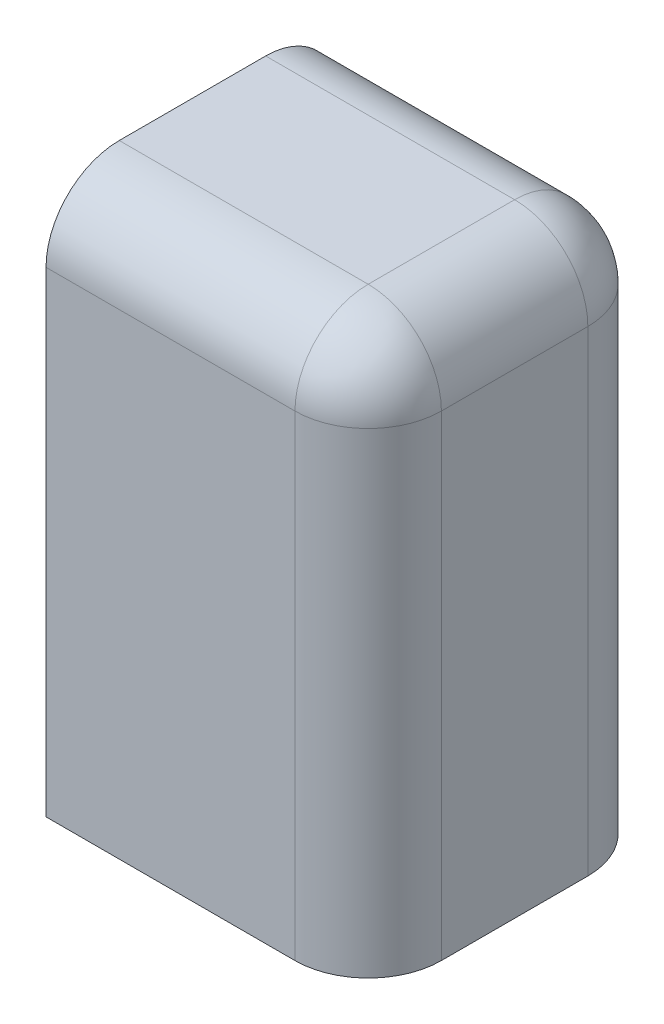
ISO-10303-21;
HEADER;
FILE_DESCRIPTION(('STEP AP214'),'2;1');
FILE_NAME('part.step','',(''),(''),'','','');
FILE_SCHEMA(('AUTOMOTIVE_DESIGN { 1 0 10303 214 1 1 1 1 }'));
ENDSEC;
DATA;
#1=APPLICATION_CONTEXT('core data for automotive mechanical design processes');
#2=APPLICATION_PROTOCOL_DEFINITION('international standard','automotive_design',2000,#1);
#3=PRODUCT_CONTEXT('',#1,'mechanical');
#4=PRODUCT('Part','Part','',(#3));
#5=PRODUCT_RELATED_PRODUCT_CATEGORY('part','',(#4));
#6=PRODUCT_DEFINITION_FORMATION('','',#4);
#7=PRODUCT_DEFINITION_CONTEXT('part definition',#1,'design');
#8=PRODUCT_DEFINITION('design','',#6,#7);
#9=PRODUCT_DEFINITION_SHAPE('','',#8);
#10=(LENGTH_UNIT() NAMED_UNIT(*) SI_UNIT(.MILLI.,.METRE.));
#11=(NAMED_UNIT(*) PLANE_ANGLE_UNIT() SI_UNIT($,.RADIAN.));
#12=(NAMED_UNIT(*) SI_UNIT($,.STERADIAN.) SOLID_ANGLE_UNIT());
#13=UNCERTAINTY_MEASURE_WITH_UNIT(LENGTH_MEASURE(1.E-05),#10,'distance_accuracy_value','');
#14=(GEOMETRIC_REPRESENTATION_CONTEXT(3) GLOBAL_UNCERTAINTY_ASSIGNED_CONTEXT((#13)) GLOBAL_UNIT_ASSIGNED_CONTEXT((#10,
#11,#12)) REPRESENTATION_CONTEXT('',''));
#15=CARTESIAN_POINT('',(0.,0.,0.));
#16=DIRECTION('',(0.,0.,1.));
#17=DIRECTION('',(1.,0.,0.));
#18=AXIS2_PLACEMENT_3D('',#15,#16,#17);
#19=CARTESIAN_POINT('',(0.,7.5,0.));
#20=DIRECTION('',(1.,0.,0.));
#21=DIRECTION('',(0.,0.,-1.));
#22=AXIS2_PLACEMENT_3D('',#19,#20,#21);
#23=PLANE('',#22);
#24=DIRECTION('',(0.,-1.,0.));
#25=VECTOR('',#24,1.);
#26=CARTESIAN_POINT('',(0.,7.5,0.));
#27=LINE('',#26,#25);
#28=CARTESIAN_POINT('',(0.,6.5,0.));
#29=VERTEX_POINT('',#28);
#30=CARTESIAN_POINT('',(0.,0.,0.));
#31=VERTEX_POINT('',#30);
#32=EDGE_CURVE('E112',#29,#31,#27,.T.);
#33=ORIENTED_EDGE('',*,*,#32,.F.);
#34=CARTESIAN_POINT('',(0.,6.5,-1.));
#35=DIRECTION('',(1.,0.,0.));
#36=DIRECTION('',(0.,0.,-1.));
#37=AXIS2_PLACEMENT_3D('',#34,#35,#36);
#38=CIRCLE('',#37,1.);
#39=CARTESIAN_POINT('',(0.,7.5,-1.));
#40=VERTEX_POINT('',#39);
#41=EDGE_CURVE('E173',#29,#40,#38,.F.);
#42=ORIENTED_EDGE('',*,*,#41,.T.);
#43=DIRECTION('',(0.,0.,1.));
#44=VECTOR('',#43,1.);
#45=CARTESIAN_POINT('',(0.,7.5,0.));
#46=LINE('',#45,#44);
#47=CARTESIAN_POINT('',(0.,7.5,-3.));
#48=VERTEX_POINT('',#47);
#49=EDGE_CURVE('E146',#48,#40,#46,.T.);
#50=ORIENTED_EDGE('',*,*,#49,.F.);
#51=CARTESIAN_POINT('',(0.,6.5,-3.));
#52=DIRECTION('',(1.,0.,0.));
#53=DIRECTION('',(0.,0.,-1.));
#54=AXIS2_PLACEMENT_3D('',#51,#52,#53);
#55=CIRCLE('',#54,1.);
#56=CARTESIAN_POINT('',(0.,6.5,-4.));
#57=VERTEX_POINT('',#56);
#58=EDGE_CURVE('E170',#48,#57,#55,.F.);
#59=ORIENTED_EDGE('',*,*,#58,.T.);
#60=DIRECTION('',(0.,-1.,0.));
#61=VECTOR('',#60,1.);
#62=CARTESIAN_POINT('',(0.,7.5,-4.));
#63=LINE('',#62,#61);
#64=CARTESIAN_POINT('',(0.,0.,-4.));
#65=VERTEX_POINT('',#64);
#66=EDGE_CURVE('E124',#57,#65,#63,.T.);
#67=ORIENTED_EDGE('',*,*,#66,.T.);
#68=DIRECTION('',(0.,0.,1.));
#69=VECTOR('',#68,1.);
#70=CARTESIAN_POINT('',(0.,0.,0.));
#71=LINE('',#70,#69);
#72=EDGE_CURVE('E130',#65,#31,#71,.T.);
#73=ORIENTED_EDGE('',*,*,#72,.T.);
#74=EDGE_LOOP('',(#33,#42,#50,#59,#67,#73));
#75=FACE_BOUND('',#74,.T.);
#76=ADVANCED_FACE('F45',(#75),#23,.F.);
#77=CARTESIAN_POINT('',(0.,7.5,0.));
#78=DIRECTION('',(0.,0.,-1.));
#79=DIRECTION('',(-1.,0.,0.));
#80=AXIS2_PLACEMENT_3D('',#77,#78,#79);
#81=PLANE('',#80);
#82=DIRECTION('',(0.,-1.,0.));
#83=VECTOR('',#82,1.);
#84=CARTESIAN_POINT('',(3.4,7.5,0.));
#85=LINE('',#84,#83);
#86=CARTESIAN_POINT('',(3.4,0.,0.));
#87=VERTEX_POINT('',#86);
#88=CARTESIAN_POINT('',(3.4,6.5,0.));
#89=VERTEX_POINT('',#88);
#90=EDGE_CURVE('E165',#87,#89,#85,.F.);
#91=ORIENTED_EDGE('',*,*,#90,.T.);
#92=DIRECTION('',(1.,0.,0.));
#93=VECTOR('',#92,1.);
#94=CARTESIAN_POINT('',(0.,6.5,0.));
#95=LINE('',#94,#93);
#96=EDGE_CURVE('E118',#89,#29,#95,.F.);
#97=ORIENTED_EDGE('',*,*,#96,.T.);
#98=ORIENTED_EDGE('',*,*,#32,.T.);
#99=DIRECTION('',(1.,0.,0.));
#100=VECTOR('',#99,1.);
#101=CARTESIAN_POINT('',(0.,0.,0.));
#102=LINE('',#101,#100);
#103=EDGE_CURVE('E115',#31,#87,#102,.T.);
#104=ORIENTED_EDGE('',*,*,#103,.T.);
#105=EDGE_LOOP('',(#91,#97,#98,#104));
#106=FACE_BOUND('',#105,.T.);
#107=ADVANCED_FACE('F114',(#106),#81,.F.);
#108=CARTESIAN_POINT('',(4.4,7.5,0.));
#109=DIRECTION('',(-1.,0.,0.));
#110=DIRECTION('',(0.,0.,1.));
#111=AXIS2_PLACEMENT_3D('',#108,#109,#110);
#112=PLANE('',#111);
#113=DIRECTION('',(0.,0.,-1.));
#114=VECTOR('',#113,1.);
#115=CARTESIAN_POINT('',(4.4,0.,0.));
#116=LINE('',#115,#114);
#117=CARTESIAN_POINT('',(4.4,0.,-1.));
#118=VERTEX_POINT('',#117);
#119=CARTESIAN_POINT('',(4.4,0.,-3.));
#120=VERTEX_POINT('',#119);
#121=EDGE_CURVE('E134',#118,#120,#116,.T.);
#122=ORIENTED_EDGE('',*,*,#121,.T.);
#123=DIRECTION('',(0.,-1.,0.));
#124=VECTOR('',#123,1.);
#125=CARTESIAN_POINT('',(4.4,7.5,-3.));
#126=LINE('',#125,#124);
#127=CARTESIAN_POINT('',(4.4,6.5,-3.));
#128=VERTEX_POINT('',#127);
#129=EDGE_CURVE('E63',#120,#128,#126,.F.);
#130=ORIENTED_EDGE('',*,*,#129,.T.);
#131=DIRECTION('',(0.,0.,-1.));
#132=VECTOR('',#131,1.);
#133=CARTESIAN_POINT('',(4.4,6.5,0.));
#134=LINE('',#133,#132);
#135=CARTESIAN_POINT('',(4.4,6.5,-1.));
#136=VERTEX_POINT('',#135);
#137=EDGE_CURVE('E68',#128,#136,#134,.F.);
#138=ORIENTED_EDGE('',*,*,#137,.T.);
#139=DIRECTION('',(0.,-1.,0.));
#140=VECTOR('',#139,1.);
#141=CARTESIAN_POINT('',(4.4,7.5,-1.));
#142=LINE('',#141,#140);
#143=EDGE_CURVE('E182',#136,#118,#142,.T.);
#144=ORIENTED_EDGE('',*,*,#143,.T.);
#145=EDGE_LOOP('',(#122,#130,#138,#144));
#146=FACE_BOUND('',#145,.T.);
#147=ADVANCED_FACE('F240',(#146),#112,.F.);
#148=CARTESIAN_POINT('',(0.,7.5,-4.));
#149=DIRECTION('',(0.,0.,1.));
#150=DIRECTION('',(1.,0.,0.));
#151=AXIS2_PLACEMENT_3D('',#148,#149,#150);
#152=PLANE('',#151);
#153=ORIENTED_EDGE('',*,*,#66,.F.);
#154=DIRECTION('',(-1.,0.,0.));
#155=VECTOR('',#154,1.);
#156=CARTESIAN_POINT('',(0.,6.5,-4.));
#157=LINE('',#156,#155);
#158=CARTESIAN_POINT('',(3.4,6.5,-4.));
#159=VERTEX_POINT('',#158);
#160=EDGE_CURVE('E179',#57,#159,#157,.F.);
#161=ORIENTED_EDGE('',*,*,#160,.T.);
#162=DIRECTION('',(0.,-1.,0.));
#163=VECTOR('',#162,1.);
#164=CARTESIAN_POINT('',(3.4,7.5,-4.));
#165=LINE('',#164,#163);
#166=CARTESIAN_POINT('',(3.4,0.,-4.));
#167=VERTEX_POINT('',#166);
#168=EDGE_CURVE('E176',#159,#167,#165,.T.);
#169=ORIENTED_EDGE('',*,*,#168,.T.);
#170=DIRECTION('',(-1.,0.,0.));
#171=VECTOR('',#170,1.);
#172=CARTESIAN_POINT('',(0.,0.,-4.));
#173=LINE('',#172,#171);
#174=EDGE_CURVE('E151',#167,#65,#173,.T.);
#175=ORIENTED_EDGE('',*,*,#174,.T.);
#176=EDGE_LOOP('',(#153,#161,#169,#175));
#177=FACE_BOUND('',#176,.T.);
#178=ADVANCED_FACE('F230',(#177),#152,.F.);
#179=CARTESIAN_POINT('',(0.,7.5,0.));
#180=DIRECTION('',(0.,-1.,0.));
#181=DIRECTION('',(0.,0.,-1.));
#182=AXIS2_PLACEMENT_3D('',#179,#180,#181);
#183=PLANE('',#182);
#184=ORIENTED_EDGE('',*,*,#49,.T.);
#185=DIRECTION('',(1.,0.,0.));
#186=VECTOR('',#185,1.);
#187=CARTESIAN_POINT('',(0.,7.5,-1.));
#188=LINE('',#187,#186);
#189=CARTESIAN_POINT('',(3.4,7.5,-1.));
#190=VERTEX_POINT('',#189);
#191=EDGE_CURVE('E161',#40,#190,#188,.T.);
#192=ORIENTED_EDGE('',*,*,#191,.T.);
#193=DIRECTION('',(0.,0.,-1.));
#194=VECTOR('',#193,1.);
#195=CARTESIAN_POINT('',(3.4,7.5,0.));
#196=LINE('',#195,#194);
#197=CARTESIAN_POINT('',(3.4,7.5,-3.));
#198=VERTEX_POINT('',#197);
#199=EDGE_CURVE('E123',#190,#198,#196,.T.);
#200=ORIENTED_EDGE('',*,*,#199,.T.);
#201=DIRECTION('',(-1.,0.,0.));
#202=VECTOR('',#201,1.);
#203=CARTESIAN_POINT('',(0.,7.5,-3.));
#204=LINE('',#203,#202);
#205=EDGE_CURVE('E158',#198,#48,#204,.T.);
#206=ORIENTED_EDGE('',*,*,#205,.T.);
#207=EDGE_LOOP('',(#184,#192,#200,#206));
#208=FACE_BOUND('',#207,.T.);
#209=ADVANCED_FACE('F220',(#208),#183,.F.);
#210=CARTESIAN_POINT('',(0.,0.,0.));
#211=DIRECTION('',(0.,-1.,0.));
#212=DIRECTION('',(0.,0.,-1.));
#213=AXIS2_PLACEMENT_3D('',#210,#211,#212);
#214=PLANE('',#213);
#215=CARTESIAN_POINT('',(2.4,0.,-2.));
#216=DIRECTION('',(0.,-1.,0.));
#217=DIRECTION('',(0.,0.,-1.));
#218=AXIS2_PLACEMENT_3D('',#215,#216,#217);
#219=CIRCLE('',#218,0.925);
#220=CARTESIAN_POINT('',(2.4,0.,-2.925));
#221=VERTEX_POINT('',#220);
#222=EDGE_CURVE('E143',#221,#221,#219,.T.);
#223=ORIENTED_EDGE('',*,*,#222,.F.);
#224=EDGE_LOOP('',(#223));
#225=FACE_BOUND('',#224,.T.);
#226=ORIENTED_EDGE('',*,*,#174,.F.);
#227=CARTESIAN_POINT('',(3.4,0.,-3.));
#228=DIRECTION('',(0.,-1.,0.));
#229=DIRECTION('',(0.,0.,-1.));
#230=AXIS2_PLACEMENT_3D('',#227,#228,#229);
#231=CIRCLE('',#230,1.);
#232=EDGE_CURVE('E11',#167,#120,#231,.T.);
#233=ORIENTED_EDGE('',*,*,#232,.T.);
#234=ORIENTED_EDGE('',*,*,#121,.F.);
#235=CARTESIAN_POINT('',(3.4,0.,-1.));
#236=DIRECTION('',(0.,-1.,0.));
#237=DIRECTION('',(0.,0.,-1.));
#238=AXIS2_PLACEMENT_3D('',#235,#236,#237);
#239=CIRCLE('',#238,1.);
#240=EDGE_CURVE('E55',#118,#87,#239,.T.);
#241=ORIENTED_EDGE('',*,*,#240,.T.);
#242=ORIENTED_EDGE('',*,*,#103,.F.);
#243=ORIENTED_EDGE('',*,*,#72,.F.);
#244=EDGE_LOOP('',(#226,#233,#234,#241,#242,#243));
#245=FACE_BOUND('',#244,.T.);
#246=ADVANCED_FACE('F129',(#225,#245),#214,.T.);
#247=CARTESIAN_POINT('',(2.4,5.5,-2.));
#248=DIRECTION('',(0.,-1.,0.));
#249=DIRECTION('',(0.,0.,-1.));
#250=AXIS2_PLACEMENT_3D('',#247,#248,#249);
#251=CYLINDRICAL_SURFACE('',#250,0.925);
#252=CARTESIAN_POINT('',(2.4,5.5,-2.));
#253=DIRECTION('',(0.,-1.,0.));
#254=DIRECTION('',(0.,0.,-1.));
#255=AXIS2_PLACEMENT_3D('',#252,#253,#254);
#256=CIRCLE('',#255,0.925);
#257=CARTESIAN_POINT('',(2.4,5.5,-2.925));
#258=VERTEX_POINT('',#257);
#259=EDGE_CURVE('E139',#258,#258,#256,.T.);
#260=ORIENTED_EDGE('',*,*,#259,.F.);
#261=EDGE_LOOP('',(#260));
#262=FACE_BOUND('',#261,.T.);
#263=ORIENTED_EDGE('',*,*,#222,.T.);
#264=EDGE_LOOP('',(#263));
#265=FACE_BOUND('',#264,.T.);
#266=ADVANCED_FACE('F217',(#262,#265),#251,.F.);
#267=CARTESIAN_POINT('',(2.4,5.5,-2.));
#268=DIRECTION('',(0.,-1.,0.));
#269=DIRECTION('',(0.,0.,-1.));
#270=AXIS2_PLACEMENT_3D('',#267,#268,#269);
#271=PLANE('',#270);
#272=ORIENTED_EDGE('',*,*,#259,.T.);
#273=EDGE_LOOP('',(#272));
#274=FACE_BOUND('',#273,.T.);
#275=ADVANCED_FACE('F227',(#274),#271,.T.);
#276=CARTESIAN_POINT('',(0.,6.5,-3.));
#277=DIRECTION('',(-1.,0.,0.));
#278=DIRECTION('',(0.,0.,1.));
#279=AXIS2_PLACEMENT_3D('',#276,#277,#278);
#280=CYLINDRICAL_SURFACE('',#279,1.);
#281=ORIENTED_EDGE('',*,*,#58,.F.);
#282=ORIENTED_EDGE('',*,*,#205,.F.);
#283=CARTESIAN_POINT('',(3.4,6.5,-3.));
#284=DIRECTION('',(1.,0.,0.));
#285=DIRECTION('',(0.,0.,-1.));
#286=AXIS2_PLACEMENT_3D('',#283,#284,#285);
#287=CIRCLE('',#286,1.);
#288=EDGE_CURVE('E49',#159,#198,#287,.T.);
#289=ORIENTED_EDGE('',*,*,#288,.F.);
#290=ORIENTED_EDGE('',*,*,#160,.F.);
#291=EDGE_LOOP('',(#281,#282,#289,#290));
#292=FACE_BOUND('',#291,.T.);
#293=ADVANCED_FACE('F47',(#292),#280,.T.);
#294=CARTESIAN_POINT('',(3.4,7.5,-3.));
#295=DIRECTION('',(0.,-1.,0.));
#296=DIRECTION('',(0.,0.,-1.));
#297=AXIS2_PLACEMENT_3D('',#294,#295,#296);
#298=CYLINDRICAL_SURFACE('',#297,1.);
#299=ORIENTED_EDGE('',*,*,#232,.F.);
#300=ORIENTED_EDGE('',*,*,#168,.F.);
#301=CARTESIAN_POINT('',(3.4,6.5,-3.));
#302=DIRECTION('',(0.,1.,0.));
#303=DIRECTION('',(0.,0.,1.));
#304=AXIS2_PLACEMENT_3D('',#301,#302,#303);
#305=CIRCLE('',#304,1.);
#306=EDGE_CURVE('E205',#128,#159,#305,.T.);
#307=ORIENTED_EDGE('',*,*,#306,.F.);
#308=ORIENTED_EDGE('',*,*,#129,.F.);
#309=EDGE_LOOP('',(#299,#300,#307,#308));
#310=FACE_BOUND('',#309,.T.);
#311=ADVANCED_FACE('F262',(#310),#298,.T.);
#312=CARTESIAN_POINT('',(3.4,6.5,-3.));
#313=DIRECTION('',(0.,0.,-1.));
#314=DIRECTION('',(-1.,0.,0.));
#315=AXIS2_PLACEMENT_3D('',#312,#313,#314);
#316=SPHERICAL_SURFACE('',#315,1.);
#317=ORIENTED_EDGE('',*,*,#306,.T.);
#318=ORIENTED_EDGE('',*,*,#288,.T.);
#319=CARTESIAN_POINT('',(3.4,6.5,-3.));
#320=DIRECTION('',(0.,0.,-1.));
#321=DIRECTION('',(-1.,0.,0.));
#322=AXIS2_PLACEMENT_3D('',#319,#320,#321);
#323=CIRCLE('',#322,1.);
#324=EDGE_CURVE('E202',#128,#198,#323,.F.);
#325=ORIENTED_EDGE('',*,*,#324,.F.);
#326=EDGE_LOOP('',(#317,#318,#325));
#327=FACE_BOUND('',#326,.T.);
#328=ADVANCED_FACE('F259',(#327),#316,.T.);
#329=CARTESIAN_POINT('',(3.4,6.5,0.));
#330=DIRECTION('',(0.,0.,-1.));
#331=DIRECTION('',(-1.,0.,0.));
#332=AXIS2_PLACEMENT_3D('',#329,#330,#331);
#333=CYLINDRICAL_SURFACE('',#332,1.);
#334=ORIENTED_EDGE('',*,*,#324,.T.);
#335=ORIENTED_EDGE('',*,*,#199,.F.);
#336=CARTESIAN_POINT('',(3.4,6.5,-1.));
#337=DIRECTION('',(0.,0.,1.));
#338=DIRECTION('',(1.,0.,0.));
#339=AXIS2_PLACEMENT_3D('',#336,#337,#338);
#340=CIRCLE('',#339,1.);
#341=EDGE_CURVE('E198',#136,#190,#340,.T.);
#342=ORIENTED_EDGE('',*,*,#341,.F.);
#343=ORIENTED_EDGE('',*,*,#137,.F.);
#344=EDGE_LOOP('',(#334,#335,#342,#343));
#345=FACE_BOUND('',#344,.T.);
#346=ADVANCED_FACE('F255',(#345),#333,.T.);
#347=CARTESIAN_POINT('',(3.4,7.5,-1.));
#348=DIRECTION('',(0.,-1.,0.));
#349=DIRECTION('',(0.,0.,-1.));
#350=AXIS2_PLACEMENT_3D('',#347,#348,#349);
#351=CYLINDRICAL_SURFACE('',#350,1.);
#352=ORIENTED_EDGE('',*,*,#240,.F.);
#353=ORIENTED_EDGE('',*,*,#143,.F.);
#354=CARTESIAN_POINT('',(3.4,6.5,-1.));
#355=DIRECTION('',(0.,1.,0.));
#356=DIRECTION('',(0.,0.,1.));
#357=AXIS2_PLACEMENT_3D('',#354,#355,#356);
#358=CIRCLE('',#357,1.);
#359=EDGE_CURVE('E194',#89,#136,#358,.T.);
#360=ORIENTED_EDGE('',*,*,#359,.F.);
#361=ORIENTED_EDGE('',*,*,#90,.F.);
#362=EDGE_LOOP('',(#352,#353,#360,#361));
#363=FACE_BOUND('',#362,.T.);
#364=ADVANCED_FACE('F251',(#363),#351,.T.);
#365=CARTESIAN_POINT('',(3.4,6.5,-1.));
#366=DIRECTION('',(1.,0.,0.));
#367=DIRECTION('',(0.,0.,-1.));
#368=AXIS2_PLACEMENT_3D('',#365,#366,#367);
#369=SPHERICAL_SURFACE('',#368,1.);
#370=ORIENTED_EDGE('',*,*,#359,.T.);
#371=ORIENTED_EDGE('',*,*,#341,.T.);
#372=CARTESIAN_POINT('',(3.4,6.5,-1.));
#373=DIRECTION('',(1.,0.,0.));
#374=DIRECTION('',(0.,0.,-1.));
#375=AXIS2_PLACEMENT_3D('',#372,#373,#374);
#376=CIRCLE('',#375,1.);
#377=EDGE_CURVE('E191',#89,#190,#376,.F.);
#378=ORIENTED_EDGE('',*,*,#377,.F.);
#379=EDGE_LOOP('',(#370,#371,#378));
#380=FACE_BOUND('',#379,.T.);
#381=ADVANCED_FACE('F247',(#380),#369,.T.);
#382=CARTESIAN_POINT('',(0.,6.5,-1.));
#383=DIRECTION('',(1.,0.,0.));
#384=DIRECTION('',(0.,0.,-1.));
#385=AXIS2_PLACEMENT_3D('',#382,#383,#384);
#386=CYLINDRICAL_SURFACE('',#385,1.);
#387=ORIENTED_EDGE('',*,*,#41,.F.);
#388=ORIENTED_EDGE('',*,*,#96,.F.);
#389=ORIENTED_EDGE('',*,*,#377,.T.);
#390=ORIENTED_EDGE('',*,*,#191,.F.);
#391=EDGE_LOOP('',(#387,#388,#389,#390));
#392=FACE_BOUND('',#391,.T.);
#393=ADVANCED_FACE('F244',(#392),#386,.T.);
#394=CLOSED_SHELL('',(#76,#107,#147,#178,#209,#246,#266,#275,#293,#311,#328,#346,#364,#381,#393));
#395=MANIFOLD_SOLID_BREP('B2',#394);
#396=ADVANCED_BREP_SHAPE_REPRESENTATION('',(#18,#395),#14);
#397=SHAPE_DEFINITION_REPRESENTATION(#9,#396);
ENDSEC;
END-ISO-10303-21;
